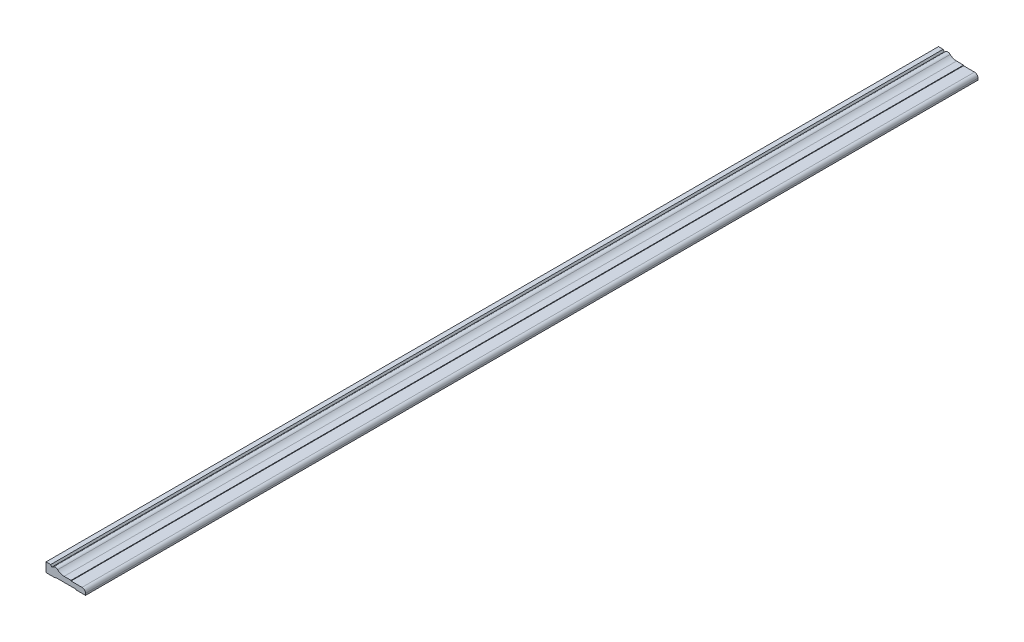
ISO-10303-21;
HEADER;
FILE_DESCRIPTION(('STEP AP214'),'2;1');
FILE_NAME('part.step','',(''),(''),'','','');
FILE_SCHEMA(('AUTOMOTIVE_DESIGN { 1 0 10303 214 1 1 1 1 }'));
ENDSEC;
DATA;
#1=APPLICATION_CONTEXT('core data for automotive mechanical design processes');
#2=APPLICATION_PROTOCOL_DEFINITION('international standard','automotive_design',2000,#1);
#3=PRODUCT_CONTEXT('',#1,'mechanical');
#4=PRODUCT('Part','Part','',(#3));
#5=PRODUCT_RELATED_PRODUCT_CATEGORY('part','',(#4));
#6=PRODUCT_DEFINITION_FORMATION('','',#4);
#7=PRODUCT_DEFINITION_CONTEXT('part definition',#1,'design');
#8=PRODUCT_DEFINITION('design','',#6,#7);
#9=PRODUCT_DEFINITION_SHAPE('','',#8);
#10=(LENGTH_UNIT() NAMED_UNIT(*) SI_UNIT(.MILLI.,.METRE.));
#11=(NAMED_UNIT(*) PLANE_ANGLE_UNIT() SI_UNIT($,.RADIAN.));
#12=(NAMED_UNIT(*) SI_UNIT($,.STERADIAN.) SOLID_ANGLE_UNIT());
#13=UNCERTAINTY_MEASURE_WITH_UNIT(LENGTH_MEASURE(1.E-05),#10,'distance_accuracy_value','');
#14=(GEOMETRIC_REPRESENTATION_CONTEXT(3) GLOBAL_UNCERTAINTY_ASSIGNED_CONTEXT((#13)) GLOBAL_UNIT_ASSIGNED_CONTEXT((#10,
#11,#12)) REPRESENTATION_CONTEXT('',''));
#15=CARTESIAN_POINT('',(0.,0.,0.));
#16=DIRECTION('',(0.,0.,1.));
#17=DIRECTION('',(1.,0.,0.));
#18=AXIS2_PLACEMENT_3D('',#15,#16,#17);
#19=CARTESIAN_POINT('',(0.,0.,-2438.4));
#20=DIRECTION('',(0.,-1.,0.));
#21=DIRECTION('',(0.,0.,-1.));
#22=AXIS2_PLACEMENT_3D('',#19,#20,#21);
#23=PLANE('',#22);
#24=DIRECTION('',(1.,0.,0.));
#25=VECTOR('',#24,1.);
#26=CARTESIAN_POINT('',(0.,0.,0.));
#27=LINE('',#26,#25);
#28=CARTESIAN_POINT('',(0.,0.,0.));
#29=VERTEX_POINT('',#28);
#30=CARTESIAN_POINT('',(25.4,0.,0.));
#31=VERTEX_POINT('',#30);
#32=EDGE_CURVE('E177',#29,#31,#27,.T.);
#33=ORIENTED_EDGE('',*,*,#32,.F.);
#34=DIRECTION('',(0.,0.,1.));
#35=VECTOR('',#34,1.);
#36=CARTESIAN_POINT('',(0.,0.,-2438.4));
#37=LINE('',#36,#35);
#38=CARTESIAN_POINT('',(0.,0.,-2438.4));
#39=VERTEX_POINT('',#38);
#40=EDGE_CURVE('E11',#39,#29,#37,.T.);
#41=ORIENTED_EDGE('',*,*,#40,.F.);
#42=DIRECTION('',(1.,0.,0.));
#43=VECTOR('',#42,1.);
#44=CARTESIAN_POINT('',(0.,0.,-2438.4));
#45=LINE('',#44,#43);
#46=CARTESIAN_POINT('',(25.4,0.,-2438.4));
#47=VERTEX_POINT('',#46);
#48=EDGE_CURVE('E221',#39,#47,#45,.T.);
#49=ORIENTED_EDGE('',*,*,#48,.T.);
#50=DIRECTION('',(0.,0.,1.));
#51=VECTOR('',#50,1.);
#52=CARTESIAN_POINT('',(25.4,0.,-2438.4));
#53=LINE('',#52,#51);
#54=EDGE_CURVE('E35',#47,#31,#53,.T.);
#55=ORIENTED_EDGE('',*,*,#54,.T.);
#56=EDGE_LOOP('',(#33,#41,#49,#55));
#57=FACE_BOUND('',#56,.T.);
#58=ADVANCED_FACE('F32',(#57),#23,.T.);
#59=CARTESIAN_POINT('',(0.,0.,-2438.4));
#60=DIRECTION('',(-1.,0.,0.));
#61=DIRECTION('',(0.,0.,1.));
#62=AXIS2_PLACEMENT_3D('',#59,#60,#61);
#63=PLANE('',#62);
#64=DIRECTION('',(0.,-1.,0.));
#65=VECTOR('',#64,1.);
#66=CARTESIAN_POINT('',(0.,0.,0.));
#67=LINE('',#66,#65);
#68=CARTESIAN_POINT('',(0.,25.4,0.));
#69=VERTEX_POINT('',#68);
#70=EDGE_CURVE('E219',#69,#29,#67,.T.);
#71=ORIENTED_EDGE('',*,*,#70,.F.);
#72=DIRECTION('',(0.,0.,1.));
#73=VECTOR('',#72,1.);
#74=CARTESIAN_POINT('',(0.,25.4,-2438.4));
#75=LINE('',#74,#73);
#76=CARTESIAN_POINT('',(0.,25.4,-2438.4));
#77=VERTEX_POINT('',#76);
#78=EDGE_CURVE('E41',#77,#69,#75,.T.);
#79=ORIENTED_EDGE('',*,*,#78,.F.);
#80=DIRECTION('',(0.,-1.,0.));
#81=VECTOR('',#80,1.);
#82=CARTESIAN_POINT('',(0.,0.,-2438.4));
#83=LINE('',#82,#81);
#84=EDGE_CURVE('E167',#77,#39,#83,.T.);
#85=ORIENTED_EDGE('',*,*,#84,.T.);
#86=ORIENTED_EDGE('',*,*,#40,.T.);
#87=EDGE_LOOP('',(#71,#79,#85,#86));
#88=FACE_BOUND('',#87,.T.);
#89=ADVANCED_FACE('F249',(#88),#63,.T.);
#90=CARTESIAN_POINT('',(0.,25.4,-2438.4));
#91=DIRECTION('',(0.,1.,0.));
#92=DIRECTION('',(0.,0.,1.));
#93=AXIS2_PLACEMENT_3D('',#90,#91,#92);
#94=PLANE('',#93);
#95=DIRECTION('',(-1.,0.,0.));
#96=VECTOR('',#95,1.);
#97=CARTESIAN_POINT('',(0.,25.4,0.));
#98=LINE('',#97,#96);
#99=CARTESIAN_POINT('',(12.7,25.4,0.));
#100=VERTEX_POINT('',#99);
#101=EDGE_CURVE('E154',#100,#69,#98,.T.);
#102=ORIENTED_EDGE('',*,*,#101,.F.);
#103=DIRECTION('',(0.,0.,1.));
#104=VECTOR('',#103,1.);
#105=CARTESIAN_POINT('',(12.7,25.4,-2438.4));
#106=LINE('',#105,#104);
#107=CARTESIAN_POINT('',(12.7,25.4,-2438.4));
#108=VERTEX_POINT('',#107);
#109=EDGE_CURVE('E149',#108,#100,#106,.T.);
#110=ORIENTED_EDGE('',*,*,#109,.F.);
#111=DIRECTION('',(-1.,0.,0.));
#112=VECTOR('',#111,1.);
#113=CARTESIAN_POINT('',(0.,25.4,-2438.4));
#114=LINE('',#113,#112);
#115=EDGE_CURVE('E152',#108,#77,#114,.T.);
#116=ORIENTED_EDGE('',*,*,#115,.T.);
#117=ORIENTED_EDGE('',*,*,#78,.T.);
#118=EDGE_LOOP('',(#102,#110,#116,#117));
#119=FACE_BOUND('',#118,.T.);
#120=ADVANCED_FACE('F151',(#119),#94,.T.);
#121=CARTESIAN_POINT('',(12.7,25.4,-2438.4));
#122=DIRECTION('',(0.820325112860283,0.571897463896076,0.));
#123=DIRECTION('',(-0.571897463896076,0.820325112860284,0.));
#124=AXIS2_PLACEMENT_3D('',#121,#122,#123);
#125=PLANE('',#124);
#126=DIRECTION('',(-0.571897463896076,0.820325112860284,0.));
#127=VECTOR('',#126,1.);
#128=CARTESIAN_POINT('',(12.7,25.4,0.));
#129=LINE('',#128,#127);
#130=CARTESIAN_POINT('',(15.875,20.8458055897155,0.));
#131=VERTEX_POINT('',#130);
#132=EDGE_CURVE('E216',#131,#100,#129,.T.);
#133=ORIENTED_EDGE('',*,*,#132,.F.);
#134=DIRECTION('',(0.,0.,1.));
#135=VECTOR('',#134,1.);
#136=CARTESIAN_POINT('',(15.875,20.8458055897155,-2438.4));
#137=LINE('',#136,#135);
#138=CARTESIAN_POINT('',(15.875,20.8458055897155,-2438.4));
#139=VERTEX_POINT('',#138);
#140=EDGE_CURVE('E159',#139,#131,#137,.T.);
#141=ORIENTED_EDGE('',*,*,#140,.F.);
#142=DIRECTION('',(-0.571897463896076,0.820325112860284,0.));
#143=VECTOR('',#142,1.);
#144=CARTESIAN_POINT('',(12.7,25.4,-2438.4));
#145=LINE('',#144,#143);
#146=EDGE_CURVE('E165',#139,#108,#145,.T.);
#147=ORIENTED_EDGE('',*,*,#146,.T.);
#148=ORIENTED_EDGE('',*,*,#109,.T.);
#149=EDGE_LOOP('',(#133,#141,#147,#148));
#150=FACE_BOUND('',#149,.T.);
#151=ADVANCED_FACE('F169',(#150),#125,.T.);
#152=CARTESIAN_POINT('',(15.875,20.8458055897155,-2438.4));
#153=DIRECTION('',(-0.571897463896076,0.820325112860283,0.));
#154=DIRECTION('',(-0.820325112860283,-0.571897463896076,0.));
#155=AXIS2_PLACEMENT_3D('',#152,#153,#154);
#156=PLANE('',#155);
#157=DIRECTION('',(-0.820325112860283,-0.571897463896076,0.));
#158=VECTOR('',#157,1.);
#159=CARTESIAN_POINT('',(15.875,20.8458055897155,0.));
#160=LINE('',#159,#158);
#161=CARTESIAN_POINT('',(19.9526766563899,23.6885966999942,0.));
#162=VERTEX_POINT('',#161);
#163=EDGE_CURVE('E213',#162,#131,#160,.T.);
#164=ORIENTED_EDGE('',*,*,#163,.F.);
#165=DIRECTION('',(0.,0.,1.));
#166=VECTOR('',#165,1.);
#167=CARTESIAN_POINT('',(19.9526766563899,23.6885966999942,-2438.4));
#168=LINE('',#167,#166);
#169=CARTESIAN_POINT('',(19.9526766563899,23.6885966999942,-2438.4));
#170=VERTEX_POINT('',#169);
#171=EDGE_CURVE('E225',#170,#162,#168,.T.);
#172=ORIENTED_EDGE('',*,*,#171,.F.);
#173=DIRECTION('',(-0.820325112860283,-0.571897463896076,0.));
#174=VECTOR('',#173,1.);
#175=CARTESIAN_POINT('',(15.875,20.8458055897155,-2438.4));
#176=LINE('',#175,#174);
#177=EDGE_CURVE('E170',#170,#139,#176,.T.);
#178=ORIENTED_EDGE('',*,*,#177,.T.);
#179=ORIENTED_EDGE('',*,*,#140,.T.);
#180=EDGE_LOOP('',(#164,#172,#178,#179));
#181=FACE_BOUND('',#180,.T.);
#182=ADVANCED_FACE('F262',(#181),#156,.T.);
#183=CARTESIAN_POINT('',(25.4,15.875,-2438.4));
#184=DIRECTION('',(0.,0.,1.));
#185=DIRECTION('',(1.,0.,0.));
#186=AXIS2_PLACEMENT_3D('',#183,#184,#185);
#187=CYLINDRICAL_SURFACE('',#186,9.525);
#188=CARTESIAN_POINT('',(25.4,15.875,0.));
#189=DIRECTION('',(0.,0.,1.));
#190=DIRECTION('',(-1.,0.,0.));
#191=AXIS2_PLACEMENT_3D('',#188,#189,#190);
#192=CIRCLE('',#191,9.525);
#193=CARTESIAN_POINT('',(31.9374702723594,22.8022727272727,0.));
#194=VERTEX_POINT('',#193);
#195=EDGE_CURVE('E210',#194,#162,#192,.T.);
#196=ORIENTED_EDGE('',*,*,#195,.F.);
#197=DIRECTION('',(0.,0.,1.));
#198=VECTOR('',#197,1.);
#199=CARTESIAN_POINT('',(31.9374702723594,22.8022727272727,-2438.4));
#200=LINE('',#199,#198);
#201=CARTESIAN_POINT('',(31.9374702723594,22.8022727272727,-2438.4));
#202=VERTEX_POINT('',#201);
#203=EDGE_CURVE('E227',#202,#194,#200,.T.);
#204=ORIENTED_EDGE('',*,*,#203,.F.);
#205=CARTESIAN_POINT('',(25.4,15.875,-2438.4));
#206=DIRECTION('',(0.,0.,1.));
#207=DIRECTION('',(-1.,0.,0.));
#208=AXIS2_PLACEMENT_3D('',#205,#206,#207);
#209=CIRCLE('',#208,9.525);
#210=EDGE_CURVE('E172',#202,#170,#209,.T.);
#211=ORIENTED_EDGE('',*,*,#210,.T.);
#212=ORIENTED_EDGE('',*,*,#171,.T.);
#213=EDGE_LOOP('',(#196,#204,#211,#212));
#214=FACE_BOUND('',#213,.T.);
#215=ADVANCED_FACE('F265',(#214),#187,.T.);
#216=CARTESIAN_POINT('',(49.3707243319846,41.275,-2438.4));
#217=DIRECTION('',(0.,0.,1.));
#218=DIRECTION('',(1.,0.,0.));
#219=AXIS2_PLACEMENT_3D('',#216,#217,#218);
#220=CYLINDRICAL_SURFACE('',#219,25.4);
#221=CARTESIAN_POINT('',(49.3707243319846,41.275,0.));
#222=DIRECTION('',(0.,0.,-1.));
#223=DIRECTION('',(1.,0.,0.));
#224=AXIS2_PLACEMENT_3D('',#221,#222,#223);
#225=CIRCLE('',#224,25.4);
#226=CARTESIAN_POINT('',(49.3707243319846,15.875,0.));
#227=VERTEX_POINT('',#226);
#228=EDGE_CURVE('E207',#227,#194,#225,.T.);
#229=ORIENTED_EDGE('',*,*,#228,.F.);
#230=DIRECTION('',(0.,0.,1.));
#231=VECTOR('',#230,1.);
#232=CARTESIAN_POINT('',(49.3707243319846,15.875,-2438.4));
#233=LINE('',#232,#231);
#234=CARTESIAN_POINT('',(49.3707243319846,15.875,-2438.4));
#235=VERTEX_POINT('',#234);
#236=EDGE_CURVE('E229',#235,#227,#233,.T.);
#237=ORIENTED_EDGE('',*,*,#236,.F.);
#238=CARTESIAN_POINT('',(49.3707243319846,41.275,-2438.4));
#239=DIRECTION('',(0.,0.,-1.));
#240=DIRECTION('',(1.,0.,0.));
#241=AXIS2_PLACEMENT_3D('',#238,#239,#240);
#242=CIRCLE('',#241,25.4);
#243=EDGE_CURVE('E446',#235,#202,#242,.T.);
#244=ORIENTED_EDGE('',*,*,#243,.T.);
#245=ORIENTED_EDGE('',*,*,#203,.T.);
#246=EDGE_LOOP('',(#229,#237,#244,#245));
#247=FACE_BOUND('',#246,.T.);
#248=ADVANCED_FACE('F269',(#247),#220,.F.);
#249=CARTESIAN_POINT('',(49.3707243319846,15.875,-2438.4));
#250=DIRECTION('',(0.,1.,0.));
#251=DIRECTION('',(-1.,0.,0.));
#252=AXIS2_PLACEMENT_3D('',#249,#250,#251);
#253=PLANE('',#252);
#254=DIRECTION('',(-1.,0.,0.));
#255=VECTOR('',#254,1.);
#256=CARTESIAN_POINT('',(49.3707243319846,15.875,0.));
#257=LINE('',#256,#255);
#258=CARTESIAN_POINT('',(68.4207243319846,15.875,0.));
#259=VERTEX_POINT('',#258);
#260=EDGE_CURVE('E204',#259,#227,#257,.T.);
#261=ORIENTED_EDGE('',*,*,#260,.F.);
#262=DIRECTION('',(0.,0.,1.));
#263=VECTOR('',#262,1.);
#264=CARTESIAN_POINT('',(68.4207243319846,15.875,-2438.4));
#265=LINE('',#264,#263);
#266=CARTESIAN_POINT('',(68.4207243319846,15.875,-2438.4));
#267=VERTEX_POINT('',#266);
#268=EDGE_CURVE('E231',#267,#259,#265,.T.);
#269=ORIENTED_EDGE('',*,*,#268,.F.);
#270=DIRECTION('',(-1.,0.,0.));
#271=VECTOR('',#270,1.);
#272=CARTESIAN_POINT('',(49.3707243319846,15.875,-2438.4));
#273=LINE('',#272,#271);
#274=EDGE_CURVE('E442',#267,#235,#273,.T.);
#275=ORIENTED_EDGE('',*,*,#274,.T.);
#276=ORIENTED_EDGE('',*,*,#236,.T.);
#277=EDGE_LOOP('',(#261,#269,#275,#276));
#278=FACE_BOUND('',#277,.T.);
#279=ADVANCED_FACE('F273',(#278),#253,.T.);
#280=CARTESIAN_POINT('',(68.4207243319846,15.875,-2438.4));
#281=DIRECTION('',(1.,0.,0.));
#282=DIRECTION('',(0.,0.,-1.));
#283=AXIS2_PLACEMENT_3D('',#280,#281,#282);
#284=PLANE('',#283);
#285=DIRECTION('',(0.,1.,0.));
#286=VECTOR('',#285,1.);
#287=CARTESIAN_POINT('',(68.4207243319846,15.875,0.));
#288=LINE('',#287,#286);
#289=CARTESIAN_POINT('',(68.4207243319846,14.2875,0.));
#290=VERTEX_POINT('',#289);
#291=EDGE_CURVE('E201',#290,#259,#288,.T.);
#292=ORIENTED_EDGE('',*,*,#291,.F.);
#293=DIRECTION('',(0.,0.,1.));
#294=VECTOR('',#293,1.);
#295=CARTESIAN_POINT('',(68.4207243319846,14.2875,-2438.4));
#296=LINE('',#295,#294);
#297=CARTESIAN_POINT('',(68.4207243319846,14.2875,-2438.4));
#298=VERTEX_POINT('',#297);
#299=EDGE_CURVE('E233',#298,#290,#296,.T.);
#300=ORIENTED_EDGE('',*,*,#299,.F.);
#301=DIRECTION('',(0.,1.,0.));
#302=VECTOR('',#301,1.);
#303=CARTESIAN_POINT('',(68.4207243319846,15.875,-2438.4));
#304=LINE('',#303,#302);
#305=EDGE_CURVE('E453',#298,#267,#304,.T.);
#306=ORIENTED_EDGE('',*,*,#305,.T.);
#307=ORIENTED_EDGE('',*,*,#268,.T.);
#308=EDGE_LOOP('',(#292,#300,#306,#307));
#309=FACE_BOUND('',#308,.T.);
#310=ADVANCED_FACE('F277',(#309),#284,.T.);
#311=CARTESIAN_POINT('',(68.4207243319846,14.2875,-2438.4));
#312=DIRECTION('',(0.,1.,0.));
#313=DIRECTION('',(0.,0.,1.));
#314=AXIS2_PLACEMENT_3D('',#311,#312,#313);
#315=PLANE('',#314);
#316=DIRECTION('',(-1.,0.,0.));
#317=VECTOR('',#316,1.);
#318=CARTESIAN_POINT('',(68.4207243319846,14.2875,0.));
#319=LINE('',#318,#317);
#320=CARTESIAN_POINT('',(98.425,14.2875,0.));
#321=VERTEX_POINT('',#320);
#322=EDGE_CURVE('E198',#321,#290,#319,.T.);
#323=ORIENTED_EDGE('',*,*,#322,.F.);
#324=DIRECTION('',(0.,0.,1.));
#325=VECTOR('',#324,1.);
#326=CARTESIAN_POINT('',(98.425,14.2875,-2438.4));
#327=LINE('',#326,#325);
#328=CARTESIAN_POINT('',(98.425,14.2875,-2438.4));
#329=VERTEX_POINT('',#328);
#330=EDGE_CURVE('E235',#329,#321,#327,.T.);
#331=ORIENTED_EDGE('',*,*,#330,.F.);
#332=DIRECTION('',(-1.,0.,0.));
#333=VECTOR('',#332,1.);
#334=CARTESIAN_POINT('',(68.4207243319846,14.2875,-2438.4));
#335=LINE('',#334,#333);
#336=EDGE_CURVE('E435',#329,#298,#335,.T.);
#337=ORIENTED_EDGE('',*,*,#336,.T.);
#338=ORIENTED_EDGE('',*,*,#299,.T.);
#339=EDGE_LOOP('',(#323,#331,#337,#338));
#340=FACE_BOUND('',#339,.T.);
#341=ADVANCED_FACE('F281',(#340),#315,.T.);
#342=CARTESIAN_POINT('',(98.425,4.7625,-2438.4));
#343=DIRECTION('',(0.,0.,1.));
#344=DIRECTION('',(1.,0.,0.));
#345=AXIS2_PLACEMENT_3D('',#342,#343,#344);
#346=CYLINDRICAL_SURFACE('',#345,9.525);
#347=CARTESIAN_POINT('',(98.425,4.7625,0.));
#348=DIRECTION('',(0.,0.,1.));
#349=DIRECTION('',(1.,0.,0.));
#350=AXIS2_PLACEMENT_3D('',#347,#348,#349);
#351=CIRCLE('',#350,9.525);
#352=CARTESIAN_POINT('',(107.95,4.7625,0.));
#353=VERTEX_POINT('',#352);
#354=EDGE_CURVE('E195',#353,#321,#351,.T.);
#355=ORIENTED_EDGE('',*,*,#354,.F.);
#356=DIRECTION('',(0.,0.,1.));
#357=VECTOR('',#356,1.);
#358=CARTESIAN_POINT('',(107.95,4.7625,-2438.4));
#359=LINE('',#358,#357);
#360=CARTESIAN_POINT('',(107.95,4.7625,-2438.4));
#361=VERTEX_POINT('',#360);
#362=EDGE_CURVE('E237',#361,#353,#359,.T.);
#363=ORIENTED_EDGE('',*,*,#362,.F.);
#364=CARTESIAN_POINT('',(98.425,4.7625,-2438.4));
#365=DIRECTION('',(0.,0.,1.));
#366=DIRECTION('',(1.,0.,0.));
#367=AXIS2_PLACEMENT_3D('',#364,#365,#366);
#368=CIRCLE('',#367,9.525);
#369=EDGE_CURVE('E431',#361,#329,#368,.T.);
#370=ORIENTED_EDGE('',*,*,#369,.T.);
#371=ORIENTED_EDGE('',*,*,#330,.T.);
#372=EDGE_LOOP('',(#355,#363,#370,#371));
#373=FACE_BOUND('',#372,.T.);
#374=ADVANCED_FACE('F285',(#373),#346,.T.);
#375=CARTESIAN_POINT('',(107.95,0.,-2438.4));
#376=DIRECTION('',(1.,0.,0.));
#377=DIRECTION('',(0.,0.,-1.));
#378=AXIS2_PLACEMENT_3D('',#375,#376,#377);
#379=PLANE('',#378);
#380=DIRECTION('',(0.,1.,0.));
#381=VECTOR('',#380,1.);
#382=CARTESIAN_POINT('',(107.95,0.,0.));
#383=LINE('',#382,#381);
#384=CARTESIAN_POINT('',(107.95,0.,0.));
#385=VERTEX_POINT('',#384);
#386=EDGE_CURVE('E192',#385,#353,#383,.T.);
#387=ORIENTED_EDGE('',*,*,#386,.F.);
#388=DIRECTION('',(0.,0.,1.));
#389=VECTOR('',#388,1.);
#390=CARTESIAN_POINT('',(107.95,0.,-2438.4));
#391=LINE('',#390,#389);
#392=CARTESIAN_POINT('',(107.95,0.,-2438.4));
#393=VERTEX_POINT('',#392);
#394=EDGE_CURVE('E239',#393,#385,#391,.T.);
#395=ORIENTED_EDGE('',*,*,#394,.F.);
#396=DIRECTION('',(0.,1.,0.));
#397=VECTOR('',#396,1.);
#398=CARTESIAN_POINT('',(107.95,0.,-2438.4));
#399=LINE('',#398,#397);
#400=EDGE_CURVE('E457',#393,#361,#399,.T.);
#401=ORIENTED_EDGE('',*,*,#400,.T.);
#402=ORIENTED_EDGE('',*,*,#362,.T.);
#403=EDGE_LOOP('',(#387,#395,#401,#402));
#404=FACE_BOUND('',#403,.T.);
#405=ADVANCED_FACE('F289',(#404),#379,.T.);
#406=CARTESIAN_POINT('',(82.55,0.,-2438.4));
#407=DIRECTION('',(0.,-1.,0.));
#408=DIRECTION('',(0.,0.,-1.));
#409=AXIS2_PLACEMENT_3D('',#406,#407,#408);
#410=PLANE('',#409);
#411=DIRECTION('',(1.,0.,0.));
#412=VECTOR('',#411,1.);
#413=CARTESIAN_POINT('',(82.55,0.,0.));
#414=LINE('',#413,#412);
#415=CARTESIAN_POINT('',(82.55,0.,0.));
#416=VERTEX_POINT('',#415);
#417=EDGE_CURVE('E189',#416,#385,#414,.T.);
#418=ORIENTED_EDGE('',*,*,#417,.F.);
#419=DIRECTION('',(0.,0.,1.));
#420=VECTOR('',#419,1.);
#421=CARTESIAN_POINT('',(82.55,0.,-2438.4));
#422=LINE('',#421,#420);
#423=CARTESIAN_POINT('',(82.55,0.,-2438.4));
#424=VERTEX_POINT('',#423);
#425=EDGE_CURVE('E241',#424,#416,#422,.T.);
#426=ORIENTED_EDGE('',*,*,#425,.F.);
#427=DIRECTION('',(1.,0.,0.));
#428=VECTOR('',#427,1.);
#429=CARTESIAN_POINT('',(82.55,0.,-2438.4));
#430=LINE('',#429,#428);
#431=EDGE_CURVE('E424',#424,#393,#430,.T.);
#432=ORIENTED_EDGE('',*,*,#431,.T.);
#433=ORIENTED_EDGE('',*,*,#394,.T.);
#434=EDGE_LOOP('',(#418,#426,#432,#433));
#435=FACE_BOUND('',#434,.T.);
#436=ADVANCED_FACE('F293',(#435),#410,.T.);
#437=CARTESIAN_POINT('',(80.9625,1.5875,-2438.4));
#438=DIRECTION('',(-0.707106781186546,-0.707106781186549,0.));
#439=DIRECTION('',(0.707106781186549,-0.707106781186546,0.));
#440=AXIS2_PLACEMENT_3D('',#437,#438,#439);
#441=PLANE('',#440);
#442=DIRECTION('',(0.707106781186549,-0.707106781186546,0.));
#443=VECTOR('',#442,1.);
#444=CARTESIAN_POINT('',(80.9625,1.5875,0.));
#445=LINE('',#444,#443);
#446=CARTESIAN_POINT('',(80.9625,1.5875,0.));
#447=VERTEX_POINT('',#446);
#448=EDGE_CURVE('E186',#447,#416,#445,.T.);
#449=ORIENTED_EDGE('',*,*,#448,.F.);
#450=DIRECTION('',(0.,0.,1.));
#451=VECTOR('',#450,1.);
#452=CARTESIAN_POINT('',(80.9625,1.5875,-2438.4));
#453=LINE('',#452,#451);
#454=CARTESIAN_POINT('',(80.9625,1.5875,-2438.4));
#455=VERTEX_POINT('',#454);
#456=EDGE_CURVE('E243',#455,#447,#453,.T.);
#457=ORIENTED_EDGE('',*,*,#456,.F.);
#458=DIRECTION('',(0.707106781186549,-0.707106781186546,0.));
#459=VECTOR('',#458,1.);
#460=CARTESIAN_POINT('',(80.9625,1.5875,-2438.4));
#461=LINE('',#460,#459);
#462=EDGE_CURVE('E420',#455,#424,#461,.T.);
#463=ORIENTED_EDGE('',*,*,#462,.T.);
#464=ORIENTED_EDGE('',*,*,#425,.T.);
#465=EDGE_LOOP('',(#449,#457,#463,#464));
#466=FACE_BOUND('',#465,.T.);
#467=ADVANCED_FACE('F297',(#466),#441,.T.);
#468=CARTESIAN_POINT('',(26.9875,1.5875,-2438.4));
#469=DIRECTION('',(0.,-1.,0.));
#470=DIRECTION('',(1.,0.,0.));
#471=AXIS2_PLACEMENT_3D('',#468,#469,#470);
#472=PLANE('',#471);
#473=DIRECTION('',(1.,0.,0.));
#474=VECTOR('',#473,1.);
#475=CARTESIAN_POINT('',(26.9875,1.5875,0.));
#476=LINE('',#475,#474);
#477=CARTESIAN_POINT('',(26.9875,1.5875,0.));
#478=VERTEX_POINT('',#477);
#479=EDGE_CURVE('E183',#478,#447,#476,.T.);
#480=ORIENTED_EDGE('',*,*,#479,.F.);
#481=DIRECTION('',(0.,0.,1.));
#482=VECTOR('',#481,1.);
#483=CARTESIAN_POINT('',(26.9875,1.5875,-2438.4));
#484=LINE('',#483,#482);
#485=CARTESIAN_POINT('',(26.9875,1.5875,-2438.4));
#486=VERTEX_POINT('',#485);
#487=EDGE_CURVE('E244',#486,#478,#484,.T.);
#488=ORIENTED_EDGE('',*,*,#487,.F.);
#489=DIRECTION('',(1.,0.,0.));
#490=VECTOR('',#489,1.);
#491=CARTESIAN_POINT('',(26.9875,1.5875,-2438.4));
#492=LINE('',#491,#490);
#493=EDGE_CURVE('E461',#486,#455,#492,.T.);
#494=ORIENTED_EDGE('',*,*,#493,.T.);
#495=ORIENTED_EDGE('',*,*,#456,.T.);
#496=EDGE_LOOP('',(#480,#488,#494,#495));
#497=FACE_BOUND('',#496,.T.);
#498=ADVANCED_FACE('F301',(#497),#472,.T.);
#499=CARTESIAN_POINT('',(25.4,0.,-2438.4));
#500=DIRECTION('',(0.707106781186548,-0.707106781186546,0.));
#501=DIRECTION('',(0.707106781186547,0.707106781186549,0.));
#502=AXIS2_PLACEMENT_3D('',#499,#500,#501);
#503=PLANE('',#502);
#504=DIRECTION('',(0.707106781186546,0.707106781186548,0.));
#505=VECTOR('',#504,1.);
#506=CARTESIAN_POINT('',(25.4,0.,0.));
#507=LINE('',#506,#505);
#508=EDGE_CURVE('E180',#31,#478,#507,.T.);
#509=ORIENTED_EDGE('',*,*,#508,.F.);
#510=ORIENTED_EDGE('',*,*,#54,.F.);
#511=DIRECTION('',(0.707106781186546,0.707106781186548,0.));
#512=VECTOR('',#511,1.);
#513=CARTESIAN_POINT('',(25.4,0.,-2438.4));
#514=LINE('',#513,#512);
#515=EDGE_CURVE('E463',#47,#486,#514,.T.);
#516=ORIENTED_EDGE('',*,*,#515,.T.);
#517=ORIENTED_EDGE('',*,*,#487,.T.);
#518=EDGE_LOOP('',(#509,#510,#516,#517));
#519=FACE_BOUND('',#518,.T.);
#520=ADVANCED_FACE('F246',(#519),#503,.T.);
#521=CARTESIAN_POINT('',(98.425,4.7625,-2438.4));
#522=DIRECTION('',(0.,0.,1.));
#523=DIRECTION('',(1.,0.,0.));
#524=AXIS2_PLACEMENT_3D('',#521,#522,#523);
#525=PLANE('',#524);
#526=ORIENTED_EDGE('',*,*,#48,.F.);
#527=ORIENTED_EDGE('',*,*,#84,.F.);
#528=ORIENTED_EDGE('',*,*,#115,.F.);
#529=ORIENTED_EDGE('',*,*,#146,.F.);
#530=ORIENTED_EDGE('',*,*,#177,.F.);
#531=ORIENTED_EDGE('',*,*,#210,.F.);
#532=ORIENTED_EDGE('',*,*,#243,.F.);
#533=ORIENTED_EDGE('',*,*,#274,.F.);
#534=ORIENTED_EDGE('',*,*,#305,.F.);
#535=ORIENTED_EDGE('',*,*,#336,.F.);
#536=ORIENTED_EDGE('',*,*,#369,.F.);
#537=ORIENTED_EDGE('',*,*,#400,.F.);
#538=ORIENTED_EDGE('',*,*,#431,.F.);
#539=ORIENTED_EDGE('',*,*,#462,.F.);
#540=ORIENTED_EDGE('',*,*,#493,.F.);
#541=ORIENTED_EDGE('',*,*,#515,.F.);
#542=EDGE_LOOP('',(#526,#527,#528,#529,#530,#531,#532,#533,#534,#535,#536,#537,#538,#539,#540,#541));
#543=FACE_BOUND('',#542,.T.);
#544=ADVANCED_FACE('F163',(#543),#525,.F.);
#545=CARTESIAN_POINT('',(98.425,4.7625,0.));
#546=DIRECTION('',(0.,0.,1.));
#547=DIRECTION('',(1.,0.,0.));
#548=AXIS2_PLACEMENT_3D('',#545,#546,#547);
#549=PLANE('',#548);
#550=ORIENTED_EDGE('',*,*,#32,.T.);
#551=ORIENTED_EDGE('',*,*,#508,.T.);
#552=ORIENTED_EDGE('',*,*,#479,.T.);
#553=ORIENTED_EDGE('',*,*,#448,.T.);
#554=ORIENTED_EDGE('',*,*,#417,.T.);
#555=ORIENTED_EDGE('',*,*,#386,.T.);
#556=ORIENTED_EDGE('',*,*,#354,.T.);
#557=ORIENTED_EDGE('',*,*,#322,.T.);
#558=ORIENTED_EDGE('',*,*,#291,.T.);
#559=ORIENTED_EDGE('',*,*,#260,.T.);
#560=ORIENTED_EDGE('',*,*,#228,.T.);
#561=ORIENTED_EDGE('',*,*,#195,.T.);
#562=ORIENTED_EDGE('',*,*,#163,.T.);
#563=ORIENTED_EDGE('',*,*,#132,.T.);
#564=ORIENTED_EDGE('',*,*,#101,.T.);
#565=ORIENTED_EDGE('',*,*,#70,.T.);
#566=EDGE_LOOP('',(#550,#551,#552,#553,#554,#555,#556,#557,#558,#559,#560,#561,#562,#563,#564,#565));
#567=FACE_BOUND('',#566,.T.);
#568=ADVANCED_FACE('F248',(#567),#549,.T.);
#569=CLOSED_SHELL('',(#58,#89,#120,#151,#182,#215,#248,#279,#310,#341,#374,#405,#436,#467,#498,
#520,#544,#568));
#570=MANIFOLD_SOLID_BREP('B2',#569);
#571=ADVANCED_BREP_SHAPE_REPRESENTATION('',(#18,#570),#14);
#572=SHAPE_DEFINITION_REPRESENTATION(#9,#571);
ENDSEC;
END-ISO-10303-21;
